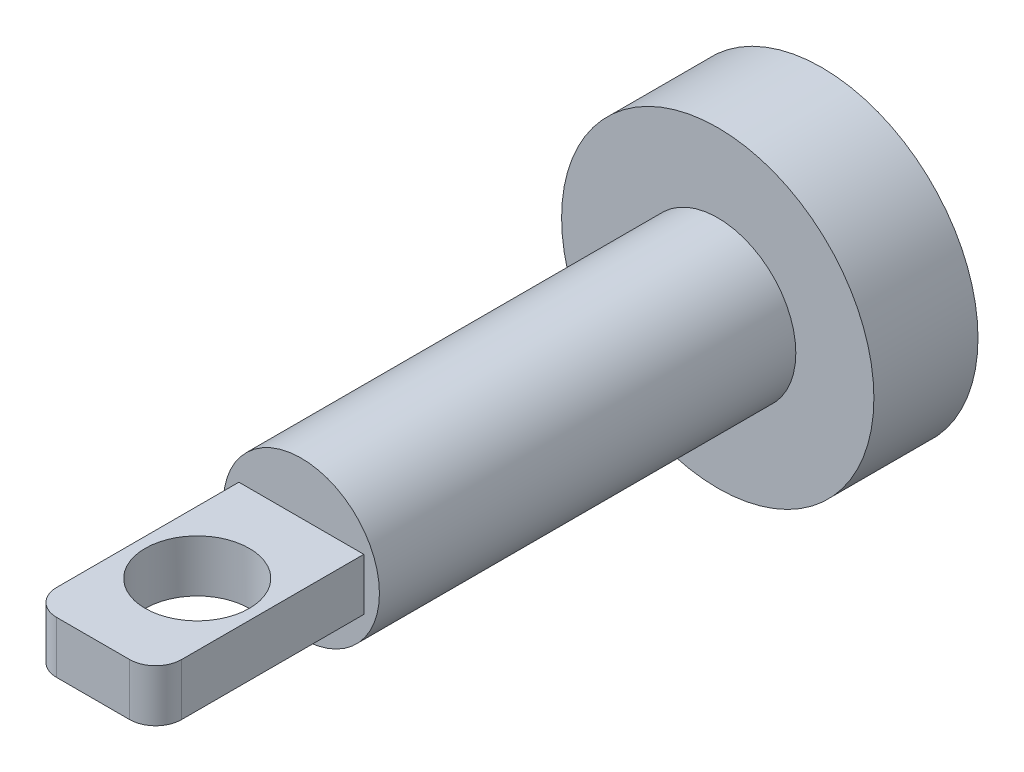
ISO-10303-21;
HEADER;
FILE_DESCRIPTION(('STEP AP214'),'2;1');
FILE_NAME('part.step','',(''),(''),'','','');
FILE_SCHEMA(('AUTOMOTIVE_DESIGN { 1 0 10303 214 1 1 1 1 }'));
ENDSEC;
DATA;
#1=APPLICATION_CONTEXT('core data for automotive mechanical design processes');
#2=APPLICATION_PROTOCOL_DEFINITION('international standard','automotive_design',2000,#1);
#3=PRODUCT_CONTEXT('',#1,'mechanical');
#4=PRODUCT('Part','Part','',(#3));
#5=PRODUCT_RELATED_PRODUCT_CATEGORY('part','',(#4));
#6=PRODUCT_DEFINITION_FORMATION('','',#4);
#7=PRODUCT_DEFINITION_CONTEXT('part definition',#1,'design');
#8=PRODUCT_DEFINITION('design','',#6,#7);
#9=PRODUCT_DEFINITION_SHAPE('','',#8);
#10=(LENGTH_UNIT() NAMED_UNIT(*) SI_UNIT(.MILLI.,.METRE.));
#11=(NAMED_UNIT(*) PLANE_ANGLE_UNIT() SI_UNIT($,.RADIAN.));
#12=(NAMED_UNIT(*) SI_UNIT($,.STERADIAN.) SOLID_ANGLE_UNIT());
#13=UNCERTAINTY_MEASURE_WITH_UNIT(LENGTH_MEASURE(1.E-05),#10,'distance_accuracy_value','');
#14=(GEOMETRIC_REPRESENTATION_CONTEXT(3) GLOBAL_UNCERTAINTY_ASSIGNED_CONTEXT((#13)) GLOBAL_UNIT_ASSIGNED_CONTEXT((#10,
#11,#12)) REPRESENTATION_CONTEXT('',''));
#15=CARTESIAN_POINT('',(0.,0.,0.));
#16=DIRECTION('',(0.,0.,1.));
#17=DIRECTION('',(1.,0.,0.));
#18=AXIS2_PLACEMENT_3D('',#15,#16,#17);
#19=CARTESIAN_POINT('',(0.,0.,12.7));
#20=DIRECTION('',(0.,0.,-1.));
#21=DIRECTION('',(-1.,0.,0.));
#22=AXIS2_PLACEMENT_3D('',#19,#20,#21);
#23=CYLINDRICAL_SURFACE('',#22,38.1);
#24=CARTESIAN_POINT('',(0.,0.,12.7));
#25=DIRECTION('',(0.,0.,1.));
#26=DIRECTION('',(1.,0.,0.));
#27=AXIS2_PLACEMENT_3D('',#24,#25,#26);
#28=CIRCLE('',#27,38.1);
#29=CARTESIAN_POINT('',(38.1,0.,12.7));
#30=VERTEX_POINT('',#29);
#31=EDGE_CURVE('E144',#30,#30,#28,.T.);
#32=ORIENTED_EDGE('',*,*,#31,.F.);
#33=EDGE_LOOP('',(#32));
#34=FACE_BOUND('',#33,.T.);
#35=CARTESIAN_POINT('',(0.,0.,-12.7));
#36=DIRECTION('',(0.,0.,1.));
#37=DIRECTION('',(1.,0.,0.));
#38=AXIS2_PLACEMENT_3D('',#35,#36,#37);
#39=CIRCLE('',#38,38.1);
#40=CARTESIAN_POINT('',(38.1,0.,-12.7));
#41=VERTEX_POINT('',#40);
#42=EDGE_CURVE('E138',#41,#41,#39,.T.);
#43=ORIENTED_EDGE('',*,*,#42,.T.);
#44=EDGE_LOOP('',(#43));
#45=FACE_BOUND('',#44,.T.);
#46=ADVANCED_FACE('F39',(#34,#45),#23,.T.);
#47=CARTESIAN_POINT('',(0.,0.,12.7));
#48=DIRECTION('',(0.,0.,1.));
#49=DIRECTION('',(1.,0.,0.));
#50=AXIS2_PLACEMENT_3D('',#47,#48,#49);
#51=PLANE('',#50);
#52=CARTESIAN_POINT('',(0.,0.,12.7));
#53=DIRECTION('',(0.,0.,1.));
#54=DIRECTION('',(1.,0.,0.));
#55=AXIS2_PLACEMENT_3D('',#52,#53,#54);
#56=CIRCLE('',#55,19.05);
#57=CARTESIAN_POINT('',(19.05,0.,12.7));
#58=VERTEX_POINT('',#57);
#59=EDGE_CURVE('E139',#58,#58,#56,.T.);
#60=ORIENTED_EDGE('',*,*,#59,.F.);
#61=EDGE_LOOP('',(#60));
#62=FACE_BOUND('',#61,.T.);
#63=ORIENTED_EDGE('',*,*,#31,.T.);
#64=EDGE_LOOP('',(#63));
#65=FACE_BOUND('',#64,.T.);
#66=ADVANCED_FACE('F205',(#62,#65),#51,.T.);
#67=CARTESIAN_POINT('',(0.,0.,-12.7));
#68=DIRECTION('',(0.,0.,1.));
#69=DIRECTION('',(1.,0.,0.));
#70=AXIS2_PLACEMENT_3D('',#67,#68,#69);
#71=PLANE('',#70);
#72=ORIENTED_EDGE('',*,*,#42,.F.);
#73=EDGE_LOOP('',(#72));
#74=FACE_BOUND('',#73,.T.);
#75=ADVANCED_FACE('F211',(#74),#71,.F.);
#76=CARTESIAN_POINT('',(0.,0.,114.3));
#77=DIRECTION('',(0.,0.,-1.));
#78=DIRECTION('',(-1.,0.,0.));
#79=AXIS2_PLACEMENT_3D('',#76,#77,#78);
#80=CYLINDRICAL_SURFACE('',#79,19.05);
#81=CARTESIAN_POINT('',(0.,0.,114.3));
#82=DIRECTION('',(0.,0.,1.));
#83=DIRECTION('',(1.,0.,0.));
#84=AXIS2_PLACEMENT_3D('',#81,#82,#83);
#85=CIRCLE('',#84,19.05);
#86=CARTESIAN_POINT('',(19.05,0.,114.3));
#87=VERTEX_POINT('',#86);
#88=EDGE_CURVE('E134',#87,#87,#85,.T.);
#89=ORIENTED_EDGE('',*,*,#88,.F.);
#90=EDGE_LOOP('',(#89));
#91=FACE_BOUND('',#90,.T.);
#92=ORIENTED_EDGE('',*,*,#59,.T.);
#93=EDGE_LOOP('',(#92));
#94=FACE_BOUND('',#93,.T.);
#95=ADVANCED_FACE('F236',(#91,#94),#80,.T.);
#96=CARTESIAN_POINT('',(0.,0.,114.3));
#97=DIRECTION('',(0.,0.,1.));
#98=DIRECTION('',(1.,0.,0.));
#99=AXIS2_PLACEMENT_3D('',#96,#97,#98);
#100=PLANE('',#99);
#101=DIRECTION('',(0.,1.,0.));
#102=VECTOR('',#101,1.);
#103=CARTESIAN_POINT('',(15.24,6.35,114.3));
#104=LINE('',#103,#102);
#105=CARTESIAN_POINT('',(15.24,-6.35,114.3));
#106=VERTEX_POINT('',#105);
#107=CARTESIAN_POINT('',(15.24,6.35,114.3));
#108=VERTEX_POINT('',#107);
#109=EDGE_CURVE('E116',#106,#108,#104,.T.);
#110=ORIENTED_EDGE('',*,*,#109,.F.);
#111=DIRECTION('',(1.,0.,0.));
#112=VECTOR('',#111,1.);
#113=CARTESIAN_POINT('',(-15.24,-6.35,114.3));
#114=LINE('',#113,#112);
#115=CARTESIAN_POINT('',(-15.24,-6.35,114.3));
#116=VERTEX_POINT('',#115);
#117=EDGE_CURVE('E111',#116,#106,#114,.T.);
#118=ORIENTED_EDGE('',*,*,#117,.F.);
#119=DIRECTION('',(0.,-1.,0.));
#120=VECTOR('',#119,1.);
#121=CARTESIAN_POINT('',(-15.24,6.35,114.3));
#122=LINE('',#121,#120);
#123=CARTESIAN_POINT('',(-15.24,6.35,114.3));
#124=VERTEX_POINT('',#123);
#125=EDGE_CURVE('E95',#124,#116,#122,.T.);
#126=ORIENTED_EDGE('',*,*,#125,.F.);
#127=DIRECTION('',(-1.,0.,0.));
#128=VECTOR('',#127,1.);
#129=CARTESIAN_POINT('',(-15.24,6.35,114.3));
#130=LINE('',#129,#128);
#131=EDGE_CURVE('E108',#108,#124,#130,.T.);
#132=ORIENTED_EDGE('',*,*,#131,.F.);
#133=EDGE_LOOP('',(#110,#118,#126,#132));
#134=FACE_BOUND('',#133,.T.);
#135=ORIENTED_EDGE('',*,*,#88,.T.);
#136=EDGE_LOOP('',(#135));
#137=FACE_BOUND('',#136,.T.);
#138=ADVANCED_FACE('F106',(#134,#137),#100,.T.);
#139=CARTESIAN_POINT('',(15.24,6.35,165.1));
#140=DIRECTION('',(-1.,0.,0.));
#141=DIRECTION('',(0.,-1.,0.));
#142=AXIS2_PLACEMENT_3D('',#139,#140,#141);
#143=PLANE('',#142);
#144=DIRECTION('',(0.,0.,-1.));
#145=VECTOR('',#144,1.);
#146=CARTESIAN_POINT('',(15.24,6.35,165.1));
#147=LINE('',#146,#145);
#148=CARTESIAN_POINT('',(15.24,6.35,158.75));
#149=VERTEX_POINT('',#148);
#150=EDGE_CURVE('E99',#149,#108,#147,.T.);
#151=ORIENTED_EDGE('',*,*,#150,.F.);
#152=DIRECTION('',(0.,1.,0.));
#153=VECTOR('',#152,1.);
#154=CARTESIAN_POINT('',(15.24,-6.35,158.75));
#155=LINE('',#154,#153);
#156=CARTESIAN_POINT('',(15.24,-6.35,158.75));
#157=VERTEX_POINT('',#156);
#158=EDGE_CURVE('E11',#149,#157,#155,.F.);
#159=ORIENTED_EDGE('',*,*,#158,.T.);
#160=DIRECTION('',(0.,0.,-1.));
#161=VECTOR('',#160,1.);
#162=CARTESIAN_POINT('',(15.24,-6.35,165.1));
#163=LINE('',#162,#161);
#164=EDGE_CURVE('E126',#157,#106,#163,.T.);
#165=ORIENTED_EDGE('',*,*,#164,.T.);
#166=ORIENTED_EDGE('',*,*,#109,.T.);
#167=EDGE_LOOP('',(#151,#159,#165,#166));
#168=FACE_BOUND('',#167,.T.);
#169=ADVANCED_FACE('F230',(#168),#143,.F.);
#170=CARTESIAN_POINT('',(-15.24,6.35,165.1));
#171=DIRECTION('',(0.,-1.,0.));
#172=DIRECTION('',(0.,0.,-1.));
#173=AXIS2_PLACEMENT_3D('',#170,#171,#172);
#174=PLANE('',#173);
#175=CARTESIAN_POINT('',(0.,6.35,139.7));
#176=DIRECTION('',(0.,-1.,0.));
#177=DIRECTION('',(0.,0.,-1.));
#178=AXIS2_PLACEMENT_3D('',#175,#176,#177);
#179=CIRCLE('',#178,12.7);
#180=CARTESIAN_POINT('',(0.,6.35,127.));
#181=VERTEX_POINT('',#180);
#182=EDGE_CURVE('E119',#181,#181,#179,.T.);
#183=ORIENTED_EDGE('',*,*,#182,.T.);
#184=EDGE_LOOP('',(#183));
#185=FACE_BOUND('',#184,.T.);
#186=DIRECTION('',(0.,0.,-1.));
#187=VECTOR('',#186,1.);
#188=CARTESIAN_POINT('',(-15.24,6.35,165.1));
#189=LINE('',#188,#187);
#190=CARTESIAN_POINT('',(-15.24,6.35,158.75));
#191=VERTEX_POINT('',#190);
#192=EDGE_CURVE('E92',#191,#124,#189,.T.);
#193=ORIENTED_EDGE('',*,*,#192,.F.);
#194=CARTESIAN_POINT('',(-8.89,6.35,158.75));
#195=DIRECTION('',(0.,-1.,0.));
#196=DIRECTION('',(0.,0.,-1.));
#197=AXIS2_PLACEMENT_3D('',#194,#195,#196);
#198=CIRCLE('',#197,6.35);
#199=CARTESIAN_POINT('',(-8.89,6.35,165.1));
#200=VERTEX_POINT('',#199);
#201=EDGE_CURVE('E49',#191,#200,#198,.F.);
#202=ORIENTED_EDGE('',*,*,#201,.T.);
#203=DIRECTION('',(-1.,0.,0.));
#204=VECTOR('',#203,1.);
#205=CARTESIAN_POINT('',(-15.24,6.35,165.1));
#206=LINE('',#205,#204);
#207=CARTESIAN_POINT('',(8.89,6.35,165.1));
#208=VERTEX_POINT('',#207);
#209=EDGE_CURVE('E125',#208,#200,#206,.T.);
#210=ORIENTED_EDGE('',*,*,#209,.F.);
#211=CARTESIAN_POINT('',(8.89,6.35,158.75));
#212=DIRECTION('',(0.,-1.,0.));
#213=DIRECTION('',(0.,0.,-1.));
#214=AXIS2_PLACEMENT_3D('',#211,#212,#213);
#215=CIRCLE('',#214,6.35);
#216=EDGE_CURVE('E56',#208,#149,#215,.F.);
#217=ORIENTED_EDGE('',*,*,#216,.T.);
#218=ORIENTED_EDGE('',*,*,#150,.T.);
#219=ORIENTED_EDGE('',*,*,#131,.T.);
#220=EDGE_LOOP('',(#193,#202,#210,#217,#218,#219));
#221=FACE_BOUND('',#220,.T.);
#222=ADVANCED_FACE('F114',(#185,#221),#174,.F.);
#223=CARTESIAN_POINT('',(-15.24,6.35,165.1));
#224=DIRECTION('',(1.,0.,0.));
#225=DIRECTION('',(0.,1.,0.));
#226=AXIS2_PLACEMENT_3D('',#223,#224,#225);
#227=PLANE('',#226);
#228=DIRECTION('',(0.,0.,-1.));
#229=VECTOR('',#228,1.);
#230=CARTESIAN_POINT('',(-15.24,-6.35,165.1));
#231=LINE('',#230,#229);
#232=CARTESIAN_POINT('',(-15.24,-6.35,158.75));
#233=VERTEX_POINT('',#232);
#234=EDGE_CURVE('E100',#233,#116,#231,.T.);
#235=ORIENTED_EDGE('',*,*,#234,.F.);
#236=DIRECTION('',(0.,-1.,0.));
#237=VECTOR('',#236,1.);
#238=CARTESIAN_POINT('',(-15.24,6.35,158.75));
#239=LINE('',#238,#237);
#240=EDGE_CURVE('E64',#233,#191,#239,.F.);
#241=ORIENTED_EDGE('',*,*,#240,.T.);
#242=ORIENTED_EDGE('',*,*,#192,.T.);
#243=ORIENTED_EDGE('',*,*,#125,.T.);
#244=EDGE_LOOP('',(#235,#241,#242,#243));
#245=FACE_BOUND('',#244,.T.);
#246=ADVANCED_FACE('F94',(#245),#227,.F.);
#247=CARTESIAN_POINT('',(-15.24,-6.35,165.1));
#248=DIRECTION('',(0.,1.,0.));
#249=DIRECTION('',(0.,0.,1.));
#250=AXIS2_PLACEMENT_3D('',#247,#248,#249);
#251=PLANE('',#250);
#252=CARTESIAN_POINT('',(0.,-6.35,139.7));
#253=DIRECTION('',(0.,1.,0.));
#254=DIRECTION('',(0.,0.,1.));
#255=AXIS2_PLACEMENT_3D('',#252,#253,#254);
#256=CIRCLE('',#255,12.7);
#257=CARTESIAN_POINT('',(0.,-6.35,152.4));
#258=VERTEX_POINT('',#257);
#259=EDGE_CURVE('E43',#258,#258,#256,.T.);
#260=ORIENTED_EDGE('',*,*,#259,.T.);
#261=EDGE_LOOP('',(#260));
#262=FACE_BOUND('',#261,.T.);
#263=DIRECTION('',(1.,0.,0.));
#264=VECTOR('',#263,1.);
#265=CARTESIAN_POINT('',(-15.24,-6.35,165.1));
#266=LINE('',#265,#264);
#267=CARTESIAN_POINT('',(-8.89,-6.35,165.1));
#268=VERTEX_POINT('',#267);
#269=CARTESIAN_POINT('',(8.89,-6.35,165.1));
#270=VERTEX_POINT('',#269);
#271=EDGE_CURVE('E129',#268,#270,#266,.T.);
#272=ORIENTED_EDGE('',*,*,#271,.F.);
#273=CARTESIAN_POINT('',(-8.89,-6.35,158.75));
#274=DIRECTION('',(0.,1.,0.));
#275=DIRECTION('',(0.,0.,1.));
#276=AXIS2_PLACEMENT_3D('',#273,#274,#275);
#277=CIRCLE('',#276,6.35);
#278=EDGE_CURVE('E161',#268,#233,#277,.F.);
#279=ORIENTED_EDGE('',*,*,#278,.T.);
#280=ORIENTED_EDGE('',*,*,#234,.T.);
#281=ORIENTED_EDGE('',*,*,#117,.T.);
#282=ORIENTED_EDGE('',*,*,#164,.F.);
#283=CARTESIAN_POINT('',(8.89,-6.35,158.75));
#284=DIRECTION('',(0.,1.,0.));
#285=DIRECTION('',(0.,0.,1.));
#286=AXIS2_PLACEMENT_3D('',#283,#284,#285);
#287=CIRCLE('',#286,6.35);
#288=EDGE_CURVE('E158',#157,#270,#287,.F.);
#289=ORIENTED_EDGE('',*,*,#288,.T.);
#290=EDGE_LOOP('',(#272,#279,#280,#281,#282,#289));
#291=FACE_BOUND('',#290,.T.);
#292=ADVANCED_FACE('F181',(#262,#291),#251,.F.);
#293=CARTESIAN_POINT('',(0.,0.,165.1));
#294=DIRECTION('',(0.,0.,1.));
#295=DIRECTION('',(1.,0.,0.));
#296=AXIS2_PLACEMENT_3D('',#293,#294,#295);
#297=PLANE('',#296);
#298=ORIENTED_EDGE('',*,*,#209,.T.);
#299=DIRECTION('',(0.,-1.,0.));
#300=VECTOR('',#299,1.);
#301=CARTESIAN_POINT('',(-8.89,-6.35,165.1));
#302=LINE('',#301,#300);
#303=EDGE_CURVE('E154',#200,#268,#302,.T.);
#304=ORIENTED_EDGE('',*,*,#303,.T.);
#305=ORIENTED_EDGE('',*,*,#271,.T.);
#306=DIRECTION('',(0.,1.,0.));
#307=VECTOR('',#306,1.);
#308=CARTESIAN_POINT('',(8.89,6.35,165.1));
#309=LINE('',#308,#307);
#310=EDGE_CURVE('E143',#270,#208,#309,.T.);
#311=ORIENTED_EDGE('',*,*,#310,.T.);
#312=EDGE_LOOP('',(#298,#304,#305,#311));
#313=FACE_BOUND('',#312,.T.);
#314=ADVANCED_FACE('F173',(#313),#297,.T.);
#315=CARTESIAN_POINT('',(-8.89,0.,158.75));
#316=DIRECTION('',(0.,1.,0.));
#317=DIRECTION('',(-1.,0.,0.));
#318=AXIS2_PLACEMENT_3D('',#315,#316,#317);
#319=CYLINDRICAL_SURFACE('',#318,6.35);
#320=ORIENTED_EDGE('',*,*,#201,.F.);
#321=ORIENTED_EDGE('',*,*,#240,.F.);
#322=ORIENTED_EDGE('',*,*,#278,.F.);
#323=ORIENTED_EDGE('',*,*,#303,.F.);
#324=EDGE_LOOP('',(#320,#321,#322,#323));
#325=FACE_BOUND('',#324,.T.);
#326=ADVANCED_FACE('F179',(#325),#319,.T.);
#327=CARTESIAN_POINT('',(8.89,0.,158.75));
#328=DIRECTION('',(0.,-1.,0.));
#329=DIRECTION('',(1.,0.,0.));
#330=AXIS2_PLACEMENT_3D('',#327,#328,#329);
#331=CYLINDRICAL_SURFACE('',#330,6.35);
#332=ORIENTED_EDGE('',*,*,#288,.F.);
#333=ORIENTED_EDGE('',*,*,#158,.F.);
#334=ORIENTED_EDGE('',*,*,#216,.F.);
#335=ORIENTED_EDGE('',*,*,#310,.F.);
#336=EDGE_LOOP('',(#332,#333,#334,#335));
#337=FACE_BOUND('',#336,.T.);
#338=ADVANCED_FACE('F41',(#337),#331,.T.);
#339=CARTESIAN_POINT('',(0.,-38.1,139.7));
#340=DIRECTION('',(0.,1.,0.));
#341=DIRECTION('',(0.,0.,1.));
#342=AXIS2_PLACEMENT_3D('',#339,#340,#341);
#343=CYLINDRICAL_SURFACE('',#342,12.7);
#344=ORIENTED_EDGE('',*,*,#259,.F.);
#345=EDGE_LOOP('',(#344));
#346=FACE_BOUND('',#345,.T.);
#347=ORIENTED_EDGE('',*,*,#182,.F.);
#348=EDGE_LOOP('',(#347));
#349=FACE_BOUND('',#348,.T.);
#350=ADVANCED_FACE('F195',(#346,#349),#343,.F.);
#351=CLOSED_SHELL('',(#46,#66,#75,#95,#138,#169,#222,#246,#292,#314,#326,#338,#350));
#352=MANIFOLD_SOLID_BREP('B2',#351);
#353=ADVANCED_BREP_SHAPE_REPRESENTATION('',(#18,#352),#14);
#354=SHAPE_DEFINITION_REPRESENTATION(#9,#353);
ENDSEC;
END-ISO-10303-21;
